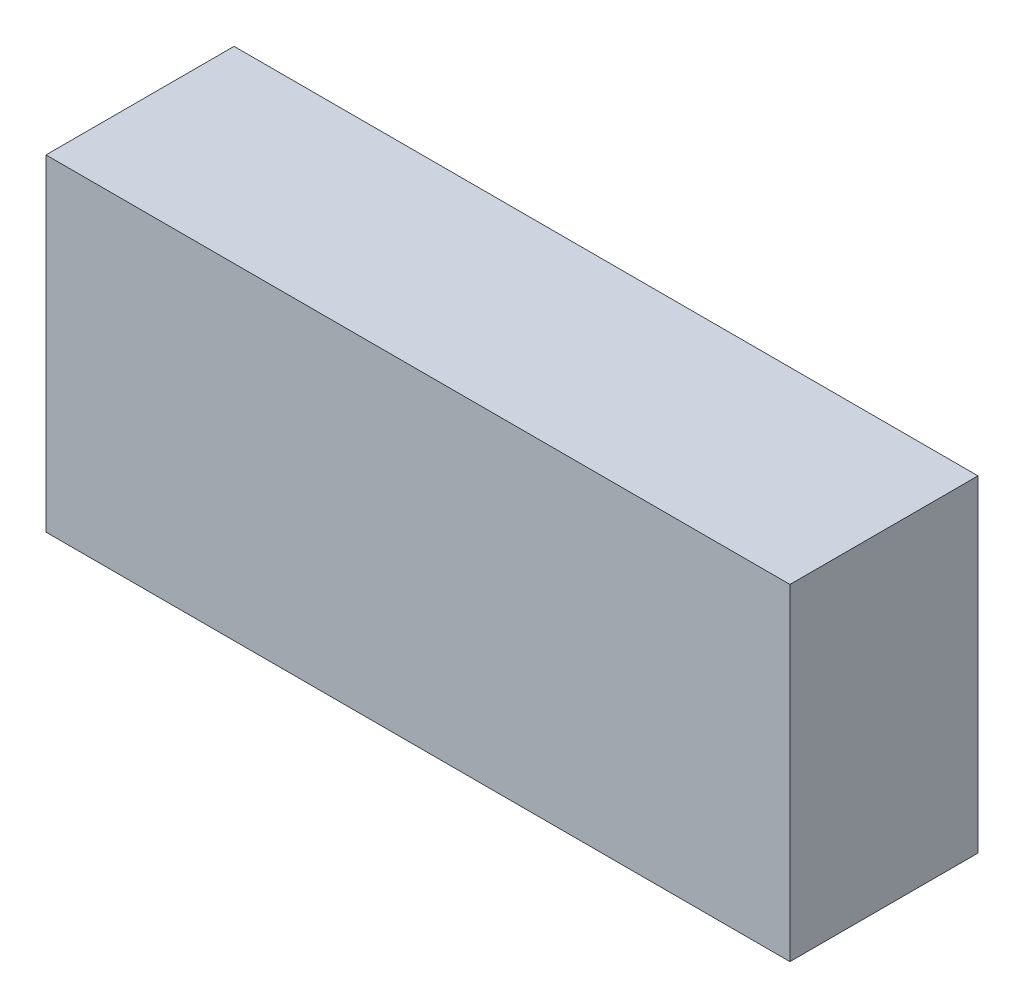
ISO-10303-21;
HEADER;
FILE_DESCRIPTION(('STEP AP214'),'2;1');
FILE_NAME('part.step','',(''),(''),'','','');
FILE_SCHEMA(('AUTOMOTIVE_DESIGN { 1 0 10303 214 1 1 1 1 }'));
ENDSEC;
DATA;
#1=APPLICATION_CONTEXT('core data for automotive mechanical design processes');
#2=APPLICATION_PROTOCOL_DEFINITION('international standard','automotive_design',2000,#1);
#3=PRODUCT_CONTEXT('',#1,'mechanical');
#4=PRODUCT('Part','Part','',(#3));
#5=PRODUCT_RELATED_PRODUCT_CATEGORY('part','',(#4));
#6=PRODUCT_DEFINITION_FORMATION('','',#4);
#7=PRODUCT_DEFINITION_CONTEXT('part definition',#1,'design');
#8=PRODUCT_DEFINITION('design','',#6,#7);
#9=PRODUCT_DEFINITION_SHAPE('','',#8);
#10=(LENGTH_UNIT() NAMED_UNIT(*) SI_UNIT(.MILLI.,.METRE.));
#11=(NAMED_UNIT(*) PLANE_ANGLE_UNIT() SI_UNIT($,.RADIAN.));
#12=(NAMED_UNIT(*) SI_UNIT($,.STERADIAN.) SOLID_ANGLE_UNIT());
#13=UNCERTAINTY_MEASURE_WITH_UNIT(LENGTH_MEASURE(1.E-05),#10,'distance_accuracy_value','');
#14=(GEOMETRIC_REPRESENTATION_CONTEXT(3) GLOBAL_UNCERTAINTY_ASSIGNED_CONTEXT((#13)) GLOBAL_UNIT_ASSIGNED_CONTEXT((#10,
#11,#12)) REPRESENTATION_CONTEXT('',''));
#15=CARTESIAN_POINT('',(0.,0.,0.));
#16=DIRECTION('',(0.,0.,1.));
#17=DIRECTION('',(1.,0.,0.));
#18=AXIS2_PLACEMENT_3D('',#15,#16,#17);
#19=CARTESIAN_POINT('',(0.,0.,14.));
#20=DIRECTION('',(1.,0.,0.));
#21=DIRECTION('',(0.,0.,-1.));
#22=AXIS2_PLACEMENT_3D('',#19,#20,#21);
#23=PLANE('',#22);
#24=DIRECTION('',(0.,-1.,0.));
#25=VECTOR('',#24,1.);
#26=CARTESIAN_POINT('',(0.,0.,0.));
#27=LINE('',#26,#25);
#28=CARTESIAN_POINT('',(0.,24.32,0.));
#29=VERTEX_POINT('',#28);
#30=CARTESIAN_POINT('',(0.,0.,0.));
#31=VERTEX_POINT('',#30);
#32=EDGE_CURVE('E95',#29,#31,#27,.T.);
#33=ORIENTED_EDGE('',*,*,#32,.T.);
#34=DIRECTION('',(0.,0.,-1.));
#35=VECTOR('',#34,1.);
#36=CARTESIAN_POINT('',(0.,0.,14.));
#37=LINE('',#36,#35);
#38=CARTESIAN_POINT('',(0.,0.,14.));
#39=VERTEX_POINT('',#38);
#40=EDGE_CURVE('E11',#39,#31,#37,.T.);
#41=ORIENTED_EDGE('',*,*,#40,.F.);
#42=DIRECTION('',(0.,-1.,0.));
#43=VECTOR('',#42,1.);
#44=CARTESIAN_POINT('',(0.,0.,14.));
#45=LINE('',#44,#43);
#46=CARTESIAN_POINT('',(0.,24.32,14.));
#47=VERTEX_POINT('',#46);
#48=EDGE_CURVE('E83',#47,#39,#45,.T.);
#49=ORIENTED_EDGE('',*,*,#48,.F.);
#50=DIRECTION('',(0.,0.,-1.));
#51=VECTOR('',#50,1.);
#52=CARTESIAN_POINT('',(0.,24.32,14.));
#53=LINE('',#52,#51);
#54=EDGE_CURVE('E91',#47,#29,#53,.T.);
#55=ORIENTED_EDGE('',*,*,#54,.T.);
#56=EDGE_LOOP('',(#33,#41,#49,#55));
#57=FACE_BOUND('',#56,.T.);
#58=ADVANCED_FACE('F32',(#57),#23,.F.);
#59=CARTESIAN_POINT('',(0.,0.,14.));
#60=DIRECTION('',(0.,1.,0.));
#61=DIRECTION('',(0.,0.,1.));
#62=AXIS2_PLACEMENT_3D('',#59,#60,#61);
#63=PLANE('',#62);
#64=DIRECTION('',(1.,0.,0.));
#65=VECTOR('',#64,1.);
#66=CARTESIAN_POINT('',(0.,0.,0.));
#67=LINE('',#66,#65);
#68=CARTESIAN_POINT('',(55.38,0.,0.));
#69=VERTEX_POINT('',#68);
#70=EDGE_CURVE('E87',#31,#69,#67,.T.);
#71=ORIENTED_EDGE('',*,*,#70,.T.);
#72=DIRECTION('',(0.,0.,-1.));
#73=VECTOR('',#72,1.);
#74=CARTESIAN_POINT('',(55.38,0.,14.));
#75=LINE('',#74,#73);
#76=CARTESIAN_POINT('',(55.38,0.,14.));
#77=VERTEX_POINT('',#76);
#78=EDGE_CURVE('E40',#77,#69,#75,.T.);
#79=ORIENTED_EDGE('',*,*,#78,.F.);
#80=DIRECTION('',(1.,0.,0.));
#81=VECTOR('',#80,1.);
#82=CARTESIAN_POINT('',(0.,0.,14.));
#83=LINE('',#82,#81);
#84=EDGE_CURVE('E78',#39,#77,#83,.T.);
#85=ORIENTED_EDGE('',*,*,#84,.F.);
#86=ORIENTED_EDGE('',*,*,#40,.T.);
#87=EDGE_LOOP('',(#71,#79,#85,#86));
#88=FACE_BOUND('',#87,.T.);
#89=ADVANCED_FACE('F86',(#88),#63,.F.);
#90=CARTESIAN_POINT('',(55.38,0.,14.));
#91=DIRECTION('',(-1.,0.,0.));
#92=DIRECTION('',(0.,0.,1.));
#93=AXIS2_PLACEMENT_3D('',#90,#91,#92);
#94=PLANE('',#93);
#95=DIRECTION('',(0.,1.,0.));
#96=VECTOR('',#95,1.);
#97=CARTESIAN_POINT('',(55.38,0.,0.));
#98=LINE('',#97,#96);
#99=CARTESIAN_POINT('',(55.38,24.32,0.));
#100=VERTEX_POINT('',#99);
#101=EDGE_CURVE('E65',#69,#100,#98,.T.);
#102=ORIENTED_EDGE('',*,*,#101,.T.);
#103=DIRECTION('',(0.,0.,-1.));
#104=VECTOR('',#103,1.);
#105=CARTESIAN_POINT('',(55.38,24.32,14.));
#106=LINE('',#105,#104);
#107=CARTESIAN_POINT('',(55.38,24.32,14.));
#108=VERTEX_POINT('',#107);
#109=EDGE_CURVE('E88',#108,#100,#106,.T.);
#110=ORIENTED_EDGE('',*,*,#109,.F.);
#111=DIRECTION('',(0.,1.,0.));
#112=VECTOR('',#111,1.);
#113=CARTESIAN_POINT('',(55.38,0.,14.));
#114=LINE('',#113,#112);
#115=EDGE_CURVE('E81',#77,#108,#114,.T.);
#116=ORIENTED_EDGE('',*,*,#115,.F.);
#117=ORIENTED_EDGE('',*,*,#78,.T.);
#118=EDGE_LOOP('',(#102,#110,#116,#117));
#119=FACE_BOUND('',#118,.T.);
#120=ADVANCED_FACE('F89',(#119),#94,.F.);
#121=CARTESIAN_POINT('',(0.,24.32,14.));
#122=DIRECTION('',(0.,-1.,0.));
#123=DIRECTION('',(0.,0.,-1.));
#124=AXIS2_PLACEMENT_3D('',#121,#122,#123);
#125=PLANE('',#124);
#126=DIRECTION('',(-1.,0.,0.));
#127=VECTOR('',#126,1.);
#128=CARTESIAN_POINT('',(0.,24.32,0.));
#129=LINE('',#128,#127);
#130=EDGE_CURVE('E71',#100,#29,#129,.T.);
#131=ORIENTED_EDGE('',*,*,#130,.T.);
#132=ORIENTED_EDGE('',*,*,#54,.F.);
#133=DIRECTION('',(-1.,0.,0.));
#134=VECTOR('',#133,1.);
#135=CARTESIAN_POINT('',(0.,24.32,14.));
#136=LINE('',#135,#134);
#137=EDGE_CURVE('E48',#108,#47,#136,.T.);
#138=ORIENTED_EDGE('',*,*,#137,.F.);
#139=ORIENTED_EDGE('',*,*,#109,.T.);
#140=EDGE_LOOP('',(#131,#132,#138,#139));
#141=FACE_BOUND('',#140,.T.);
#142=ADVANCED_FACE('F102',(#141),#125,.F.);
#143=CARTESIAN_POINT('',(0.,0.,14.));
#144=DIRECTION('',(0.,0.,-1.));
#145=DIRECTION('',(-1.,0.,0.));
#146=AXIS2_PLACEMENT_3D('',#143,#144,#145);
#147=PLANE('',#146);
#148=ORIENTED_EDGE('',*,*,#48,.T.);
#149=ORIENTED_EDGE('',*,*,#84,.T.);
#150=ORIENTED_EDGE('',*,*,#115,.T.);
#151=ORIENTED_EDGE('',*,*,#137,.T.);
#152=EDGE_LOOP('',(#148,#149,#150,#151));
#153=FACE_BOUND('',#152,.T.);
#154=ADVANCED_FACE('F79',(#153),#147,.F.);
#155=CARTESIAN_POINT('',(0.,0.,0.));
#156=DIRECTION('',(0.,0.,-1.));
#157=DIRECTION('',(-1.,0.,0.));
#158=AXIS2_PLACEMENT_3D('',#155,#156,#157);
#159=PLANE('',#158);
#160=ORIENTED_EDGE('',*,*,#32,.F.);
#161=ORIENTED_EDGE('',*,*,#130,.F.);
#162=ORIENTED_EDGE('',*,*,#101,.F.);
#163=ORIENTED_EDGE('',*,*,#70,.F.);
#164=EDGE_LOOP('',(#160,#161,#162,#163));
#165=FACE_BOUND('',#164,.T.);
#166=ADVANCED_FACE('F105',(#165),#159,.T.);
#167=CLOSED_SHELL('',(#58,#89,#120,#142,#154,#166));
#168=MANIFOLD_SOLID_BREP('B2',#167);
#169=ADVANCED_BREP_SHAPE_REPRESENTATION('',(#18,#168),#14);
#170=SHAPE_DEFINITION_REPRESENTATION(#9,#169);
ENDSEC;
END-ISO-10303-21;
